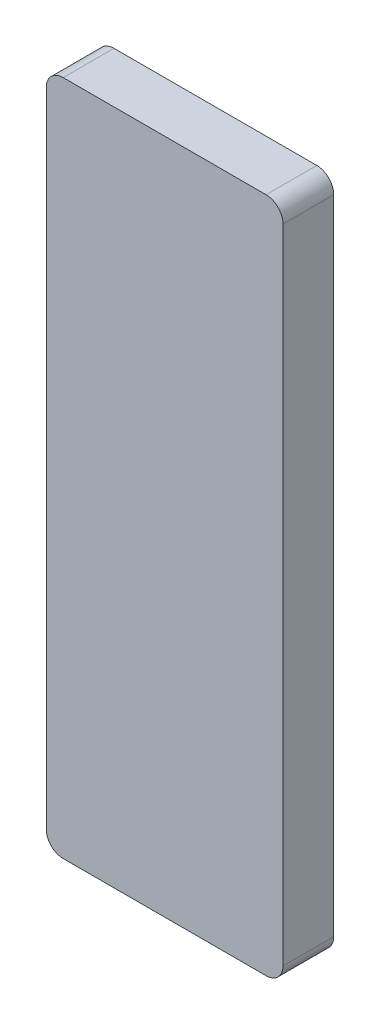
ISO-10303-21;
HEADER;
FILE_DESCRIPTION(('STEP AP214'),'2;1');
FILE_NAME('part.step','',(''),(''),'','','');
FILE_SCHEMA(('AUTOMOTIVE_DESIGN { 1 0 10303 214 1 1 1 1 }'));
ENDSEC;
DATA;
#1=APPLICATION_CONTEXT('core data for automotive mechanical design processes');
#2=APPLICATION_PROTOCOL_DEFINITION('international standard','automotive_design',2000,#1);
#3=PRODUCT_CONTEXT('',#1,'mechanical');
#4=PRODUCT('Part','Part','',(#3));
#5=PRODUCT_RELATED_PRODUCT_CATEGORY('part','',(#4));
#6=PRODUCT_DEFINITION_FORMATION('','',#4);
#7=PRODUCT_DEFINITION_CONTEXT('part definition',#1,'design');
#8=PRODUCT_DEFINITION('design','',#6,#7);
#9=PRODUCT_DEFINITION_SHAPE('','',#8);
#10=(LENGTH_UNIT() NAMED_UNIT(*) SI_UNIT(.MILLI.,.METRE.));
#11=(NAMED_UNIT(*) PLANE_ANGLE_UNIT() SI_UNIT($,.RADIAN.));
#12=(NAMED_UNIT(*) SI_UNIT($,.STERADIAN.) SOLID_ANGLE_UNIT());
#13=UNCERTAINTY_MEASURE_WITH_UNIT(LENGTH_MEASURE(1.E-05),#10,'distance_accuracy_value','');
#14=(GEOMETRIC_REPRESENTATION_CONTEXT(3) GLOBAL_UNCERTAINTY_ASSIGNED_CONTEXT((#13)) GLOBAL_UNIT_ASSIGNED_CONTEXT((#10,
#11,#12)) REPRESENTATION_CONTEXT('',''));
#15=CARTESIAN_POINT('',(0.,0.,0.));
#16=DIRECTION('',(0.,0.,1.));
#17=DIRECTION('',(1.,0.,0.));
#18=AXIS2_PLACEMENT_3D('',#15,#16,#17);
#19=CARTESIAN_POINT('',(-21.,60.,9.));
#20=DIRECTION('',(1.,0.,0.));
#21=DIRECTION('',(0.,0.,-1.));
#22=AXIS2_PLACEMENT_3D('',#19,#20,#21);
#23=PLANE('',#22);
#24=DIRECTION('',(0.,-1.,0.));
#25=VECTOR('',#24,1.);
#26=CARTESIAN_POINT('',(-21.,60.,0.));
#27=LINE('',#26,#25);
#28=CARTESIAN_POINT('',(-21.,57.,0.));
#29=VERTEX_POINT('',#28);
#30=CARTESIAN_POINT('',(-21.,-57.,0.));
#31=VERTEX_POINT('',#30);
#32=EDGE_CURVE('E127',#29,#31,#27,.T.);
#33=ORIENTED_EDGE('',*,*,#32,.T.);
#34=DIRECTION('',(0.,0.,-1.));
#35=VECTOR('',#34,1.);
#36=CARTESIAN_POINT('',(-21.,-57.,9.));
#37=LINE('',#36,#35);
#38=CARTESIAN_POINT('',(-21.,-57.,9.));
#39=VERTEX_POINT('',#38);
#40=EDGE_CURVE('E105',#31,#39,#37,.F.);
#41=ORIENTED_EDGE('',*,*,#40,.T.);
#42=DIRECTION('',(0.,-1.,0.));
#43=VECTOR('',#42,1.);
#44=CARTESIAN_POINT('',(-21.,60.,9.));
#45=LINE('',#44,#43);
#46=CARTESIAN_POINT('',(-21.,57.,9.));
#47=VERTEX_POINT('',#46);
#48=EDGE_CURVE('E136',#47,#39,#45,.T.);
#49=ORIENTED_EDGE('',*,*,#48,.F.);
#50=DIRECTION('',(0.,0.,-1.));
#51=VECTOR('',#50,1.);
#52=CARTESIAN_POINT('',(-21.,57.,9.));
#53=LINE('',#52,#51);
#54=EDGE_CURVE('E110',#47,#29,#53,.T.);
#55=ORIENTED_EDGE('',*,*,#54,.T.);
#56=EDGE_LOOP('',(#33,#41,#49,#55));
#57=FACE_BOUND('',#56,.T.);
#58=ADVANCED_FACE('F34',(#57),#23,.F.);
#59=CARTESIAN_POINT('',(-21.,-60.,9.));
#60=DIRECTION('',(0.,1.,0.));
#61=DIRECTION('',(0.,0.,1.));
#62=AXIS2_PLACEMENT_3D('',#59,#60,#61);
#63=PLANE('',#62);
#64=DIRECTION('',(1.,0.,0.));
#65=VECTOR('',#64,1.);
#66=CARTESIAN_POINT('',(-21.,-60.,9.));
#67=LINE('',#66,#65);
#68=CARTESIAN_POINT('',(-18.,-60.,9.));
#69=VERTEX_POINT('',#68);
#70=CARTESIAN_POINT('',(18.,-60.,9.));
#71=VERTEX_POINT('',#70);
#72=EDGE_CURVE('E120',#69,#71,#67,.T.);
#73=ORIENTED_EDGE('',*,*,#72,.F.);
#74=DIRECTION('',(0.,0.,-1.));
#75=VECTOR('',#74,1.);
#76=CARTESIAN_POINT('',(-18.,-60.,9.));
#77=LINE('',#76,#75);
#78=CARTESIAN_POINT('',(-18.,-60.,0.));
#79=VERTEX_POINT('',#78);
#80=EDGE_CURVE('E104',#69,#79,#77,.T.);
#81=ORIENTED_EDGE('',*,*,#80,.T.);
#82=DIRECTION('',(1.,0.,0.));
#83=VECTOR('',#82,1.);
#84=CARTESIAN_POINT('',(-21.,-60.,0.));
#85=LINE('',#84,#83);
#86=CARTESIAN_POINT('',(18.,-60.,0.));
#87=VERTEX_POINT('',#86);
#88=EDGE_CURVE('E117',#79,#87,#85,.T.);
#89=ORIENTED_EDGE('',*,*,#88,.T.);
#90=DIRECTION('',(0.,0.,-1.));
#91=VECTOR('',#90,1.);
#92=CARTESIAN_POINT('',(18.,-60.,9.));
#93=LINE('',#92,#91);
#94=EDGE_CURVE('E122',#87,#71,#93,.F.);
#95=ORIENTED_EDGE('',*,*,#94,.T.);
#96=EDGE_LOOP('',(#73,#81,#89,#95));
#97=FACE_BOUND('',#96,.T.);
#98=ADVANCED_FACE('F116',(#97),#63,.F.);
#99=CARTESIAN_POINT('',(21.,60.,9.));
#100=DIRECTION('',(-1.,0.,0.));
#101=DIRECTION('',(0.,0.,1.));
#102=AXIS2_PLACEMENT_3D('',#99,#100,#101);
#103=PLANE('',#102);
#104=DIRECTION('',(0.,1.,0.));
#105=VECTOR('',#104,1.);
#106=CARTESIAN_POINT('',(21.,60.,9.));
#107=LINE('',#106,#105);
#108=CARTESIAN_POINT('',(21.,-57.,9.));
#109=VERTEX_POINT('',#108);
#110=CARTESIAN_POINT('',(21.,57.,9.));
#111=VERTEX_POINT('',#110);
#112=EDGE_CURVE('E162',#109,#111,#107,.T.);
#113=ORIENTED_EDGE('',*,*,#112,.F.);
#114=DIRECTION('',(0.,0.,-1.));
#115=VECTOR('',#114,1.);
#116=CARTESIAN_POINT('',(21.,-57.,9.));
#117=LINE('',#116,#115);
#118=CARTESIAN_POINT('',(21.,-57.,0.));
#119=VERTEX_POINT('',#118);
#120=EDGE_CURVE('E155',#109,#119,#117,.T.);
#121=ORIENTED_EDGE('',*,*,#120,.T.);
#122=DIRECTION('',(0.,1.,0.));
#123=VECTOR('',#122,1.);
#124=CARTESIAN_POINT('',(21.,60.,0.));
#125=LINE('',#124,#123);
#126=CARTESIAN_POINT('',(21.,57.,0.));
#127=VERTEX_POINT('',#126);
#128=EDGE_CURVE('E126',#119,#127,#125,.T.);
#129=ORIENTED_EDGE('',*,*,#128,.T.);
#130=DIRECTION('',(0.,0.,-1.));
#131=VECTOR('',#130,1.);
#132=CARTESIAN_POINT('',(21.,57.,9.));
#133=LINE('',#132,#131);
#134=EDGE_CURVE('E153',#127,#111,#133,.F.);
#135=ORIENTED_EDGE('',*,*,#134,.T.);
#136=EDGE_LOOP('',(#113,#121,#129,#135));
#137=FACE_BOUND('',#136,.T.);
#138=ADVANCED_FACE('F160',(#137),#103,.F.);
#139=CARTESIAN_POINT('',(-21.,60.,9.));
#140=DIRECTION('',(0.,-1.,0.));
#141=DIRECTION('',(0.,0.,-1.));
#142=AXIS2_PLACEMENT_3D('',#139,#140,#141);
#143=PLANE('',#142);
#144=DIRECTION('',(-1.,0.,0.));
#145=VECTOR('',#144,1.);
#146=CARTESIAN_POINT('',(-21.,60.,9.));
#147=LINE('',#146,#145);
#148=CARTESIAN_POINT('',(18.,60.,9.));
#149=VERTEX_POINT('',#148);
#150=CARTESIAN_POINT('',(-18.,60.,9.));
#151=VERTEX_POINT('',#150);
#152=EDGE_CURVE('E137',#149,#151,#147,.T.);
#153=ORIENTED_EDGE('',*,*,#152,.F.);
#154=DIRECTION('',(0.,0.,-1.));
#155=VECTOR('',#154,1.);
#156=CARTESIAN_POINT('',(18.,60.,9.));
#157=LINE('',#156,#155);
#158=CARTESIAN_POINT('',(18.,60.,0.));
#159=VERTEX_POINT('',#158);
#160=EDGE_CURVE('E11',#149,#159,#157,.T.);
#161=ORIENTED_EDGE('',*,*,#160,.T.);
#162=DIRECTION('',(-1.,0.,0.));
#163=VECTOR('',#162,1.);
#164=CARTESIAN_POINT('',(-21.,60.,0.));
#165=LINE('',#164,#163);
#166=CARTESIAN_POINT('',(-18.,60.,0.));
#167=VERTEX_POINT('',#166);
#168=EDGE_CURVE('E130',#159,#167,#165,.T.);
#169=ORIENTED_EDGE('',*,*,#168,.T.);
#170=DIRECTION('',(0.,0.,-1.));
#171=VECTOR('',#170,1.);
#172=CARTESIAN_POINT('',(-18.,60.,9.));
#173=LINE('',#172,#171);
#174=EDGE_CURVE('E42',#167,#151,#173,.F.);
#175=ORIENTED_EDGE('',*,*,#174,.T.);
#176=EDGE_LOOP('',(#153,#161,#169,#175));
#177=FACE_BOUND('',#176,.T.);
#178=ADVANCED_FACE('F169',(#177),#143,.F.);
#179=CARTESIAN_POINT('',(0.,0.,9.));
#180=DIRECTION('',(0.,0.,1.));
#181=DIRECTION('',(1.,0.,0.));
#182=AXIS2_PLACEMENT_3D('',#179,#180,#181);
#183=PLANE('',#182);
#184=ORIENTED_EDGE('',*,*,#48,.T.);
#185=CARTESIAN_POINT('',(-18.,-57.,9.));
#186=DIRECTION('',(0.,0.,1.));
#187=DIRECTION('',(1.,0.,0.));
#188=AXIS2_PLACEMENT_3D('',#185,#186,#187);
#189=CIRCLE('',#188,3.);
#190=EDGE_CURVE('E151',#39,#69,#189,.T.);
#191=ORIENTED_EDGE('',*,*,#190,.T.);
#192=ORIENTED_EDGE('',*,*,#72,.T.);
#193=CARTESIAN_POINT('',(18.,-57.,9.));
#194=DIRECTION('',(0.,0.,1.));
#195=DIRECTION('',(1.,0.,0.));
#196=AXIS2_PLACEMENT_3D('',#193,#194,#195);
#197=CIRCLE('',#196,3.);
#198=EDGE_CURVE('E149',#71,#109,#197,.T.);
#199=ORIENTED_EDGE('',*,*,#198,.T.);
#200=ORIENTED_EDGE('',*,*,#112,.T.);
#201=CARTESIAN_POINT('',(18.,57.,9.));
#202=DIRECTION('',(0.,0.,1.));
#203=DIRECTION('',(1.,0.,0.));
#204=AXIS2_PLACEMENT_3D('',#201,#202,#203);
#205=CIRCLE('',#204,3.);
#206=EDGE_CURVE('E55',#111,#149,#205,.T.);
#207=ORIENTED_EDGE('',*,*,#206,.T.);
#208=ORIENTED_EDGE('',*,*,#152,.T.);
#209=CARTESIAN_POINT('',(-18.,57.,9.));
#210=DIRECTION('',(0.,0.,1.));
#211=DIRECTION('',(1.,0.,0.));
#212=AXIS2_PLACEMENT_3D('',#209,#210,#211);
#213=CIRCLE('',#212,3.);
#214=EDGE_CURVE('E146',#151,#47,#213,.T.);
#215=ORIENTED_EDGE('',*,*,#214,.T.);
#216=EDGE_LOOP('',(#184,#191,#192,#199,#200,#207,#208,#215));
#217=FACE_BOUND('',#216,.T.);
#218=ADVANCED_FACE('F176',(#217),#183,.T.);
#219=CARTESIAN_POINT('',(0.,0.,0.));
#220=DIRECTION('',(0.,0.,1.));
#221=DIRECTION('',(1.,0.,0.));
#222=AXIS2_PLACEMENT_3D('',#219,#220,#221);
#223=PLANE('',#222);
#224=ORIENTED_EDGE('',*,*,#88,.F.);
#225=CARTESIAN_POINT('',(-18.,-57.,0.));
#226=DIRECTION('',(0.,0.,1.));
#227=DIRECTION('',(1.,0.,0.));
#228=AXIS2_PLACEMENT_3D('',#225,#226,#227);
#229=CIRCLE('',#228,3.);
#230=EDGE_CURVE('E100',#79,#31,#229,.F.);
#231=ORIENTED_EDGE('',*,*,#230,.T.);
#232=ORIENTED_EDGE('',*,*,#32,.F.);
#233=CARTESIAN_POINT('',(-18.,57.,0.));
#234=DIRECTION('',(0.,0.,1.));
#235=DIRECTION('',(1.,0.,0.));
#236=AXIS2_PLACEMENT_3D('',#233,#234,#235);
#237=CIRCLE('',#236,3.);
#238=EDGE_CURVE('E121',#29,#167,#237,.F.);
#239=ORIENTED_EDGE('',*,*,#238,.T.);
#240=ORIENTED_EDGE('',*,*,#168,.F.);
#241=CARTESIAN_POINT('',(18.,57.,0.));
#242=DIRECTION('',(0.,0.,1.));
#243=DIRECTION('',(1.,0.,0.));
#244=AXIS2_PLACEMENT_3D('',#241,#242,#243);
#245=CIRCLE('',#244,3.);
#246=EDGE_CURVE('E140',#159,#127,#245,.F.);
#247=ORIENTED_EDGE('',*,*,#246,.T.);
#248=ORIENTED_EDGE('',*,*,#128,.F.);
#249=CARTESIAN_POINT('',(18.,-57.,0.));
#250=DIRECTION('',(0.,0.,1.));
#251=DIRECTION('',(1.,0.,0.));
#252=AXIS2_PLACEMENT_3D('',#249,#250,#251);
#253=CIRCLE('',#252,3.);
#254=EDGE_CURVE('E111',#119,#87,#253,.F.);
#255=ORIENTED_EDGE('',*,*,#254,.T.);
#256=EDGE_LOOP('',(#224,#231,#232,#239,#240,#247,#248,#255));
#257=FACE_BOUND('',#256,.T.);
#258=ADVANCED_FACE('F124',(#257),#223,.F.);
#259=CARTESIAN_POINT('',(-18.,-57.,9.));
#260=DIRECTION('',(0.,0.,-1.));
#261=DIRECTION('',(-1.,0.,0.));
#262=AXIS2_PLACEMENT_3D('',#259,#260,#261);
#263=CYLINDRICAL_SURFACE('',#262,3.);
#264=ORIENTED_EDGE('',*,*,#190,.F.);
#265=ORIENTED_EDGE('',*,*,#40,.F.);
#266=ORIENTED_EDGE('',*,*,#230,.F.);
#267=ORIENTED_EDGE('',*,*,#80,.F.);
#268=EDGE_LOOP('',(#264,#265,#266,#267));
#269=FACE_BOUND('',#268,.T.);
#270=ADVANCED_FACE('F103',(#269),#263,.T.);
#271=CARTESIAN_POINT('',(18.,-57.,9.));
#272=DIRECTION('',(0.,0.,-1.));
#273=DIRECTION('',(-1.,0.,0.));
#274=AXIS2_PLACEMENT_3D('',#271,#272,#273);
#275=CYLINDRICAL_SURFACE('',#274,3.);
#276=ORIENTED_EDGE('',*,*,#198,.F.);
#277=ORIENTED_EDGE('',*,*,#94,.F.);
#278=ORIENTED_EDGE('',*,*,#254,.F.);
#279=ORIENTED_EDGE('',*,*,#120,.F.);
#280=EDGE_LOOP('',(#276,#277,#278,#279));
#281=FACE_BOUND('',#280,.T.);
#282=ADVANCED_FACE('F184',(#281),#275,.T.);
#283=CARTESIAN_POINT('',(18.,57.,9.));
#284=DIRECTION('',(0.,0.,-1.));
#285=DIRECTION('',(-1.,0.,0.));
#286=AXIS2_PLACEMENT_3D('',#283,#284,#285);
#287=CYLINDRICAL_SURFACE('',#286,3.);
#288=ORIENTED_EDGE('',*,*,#206,.F.);
#289=ORIENTED_EDGE('',*,*,#134,.F.);
#290=ORIENTED_EDGE('',*,*,#246,.F.);
#291=ORIENTED_EDGE('',*,*,#160,.F.);
#292=EDGE_LOOP('',(#288,#289,#290,#291));
#293=FACE_BOUND('',#292,.T.);
#294=ADVANCED_FACE('F168',(#293),#287,.T.);
#295=CARTESIAN_POINT('',(-18.,57.,9.));
#296=DIRECTION('',(0.,0.,-1.));
#297=DIRECTION('',(-1.,0.,0.));
#298=AXIS2_PLACEMENT_3D('',#295,#296,#297);
#299=CYLINDRICAL_SURFACE('',#298,3.);
#300=ORIENTED_EDGE('',*,*,#214,.F.);
#301=ORIENTED_EDGE('',*,*,#174,.F.);
#302=ORIENTED_EDGE('',*,*,#238,.F.);
#303=ORIENTED_EDGE('',*,*,#54,.F.);
#304=EDGE_LOOP('',(#300,#301,#302,#303));
#305=FACE_BOUND('',#304,.T.);
#306=ADVANCED_FACE('F36',(#305),#299,.T.);
#307=CLOSED_SHELL('',(#58,#98,#138,#178,#218,#258,#270,#282,#294,#306));
#308=MANIFOLD_SOLID_BREP('B2',#307);
#309=ADVANCED_BREP_SHAPE_REPRESENTATION('',(#18,#308),#14);
#310=SHAPE_DEFINITION_REPRESENTATION(#9,#309);
ENDSEC;
END-ISO-10303-21;
